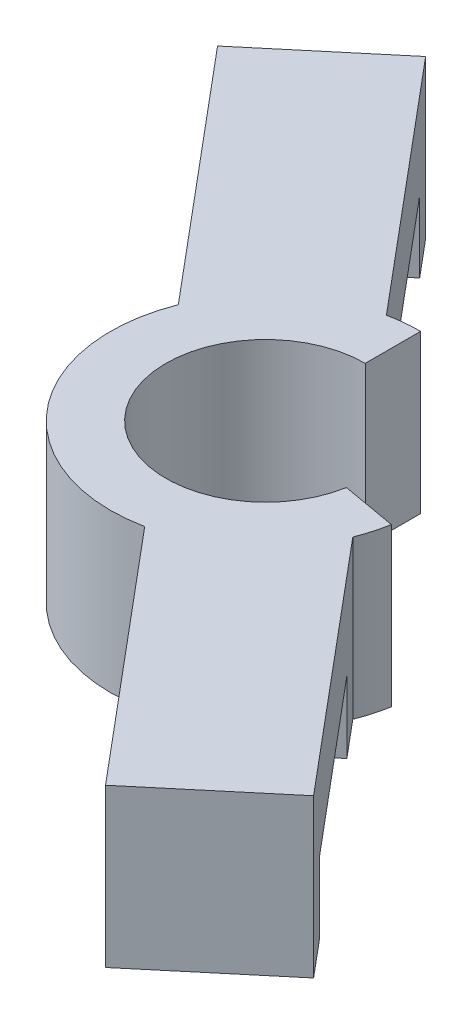
ISO-10303-21;
HEADER;
FILE_DESCRIPTION(('STEP AP214'),'2;1');
FILE_NAME('part.step','',(''),(''),'','','');
FILE_SCHEMA(('AUTOMOTIVE_DESIGN { 1 0 10303 214 1 1 1 1 }'));
ENDSEC;
DATA;
#1=APPLICATION_CONTEXT('core data for automotive mechanical design processes');
#2=APPLICATION_PROTOCOL_DEFINITION('international standard','automotive_design',2000,#1);
#3=PRODUCT_CONTEXT('',#1,'mechanical');
#4=PRODUCT('Part','Part','',(#3));
#5=PRODUCT_RELATED_PRODUCT_CATEGORY('part','',(#4));
#6=PRODUCT_DEFINITION_FORMATION('','',#4);
#7=PRODUCT_DEFINITION_CONTEXT('part definition',#1,'design');
#8=PRODUCT_DEFINITION('design','',#6,#7);
#9=PRODUCT_DEFINITION_SHAPE('','',#8);
#10=(LENGTH_UNIT() NAMED_UNIT(*) SI_UNIT(.MILLI.,.METRE.));
#11=(NAMED_UNIT(*) PLANE_ANGLE_UNIT() SI_UNIT($,.RADIAN.));
#12=(NAMED_UNIT(*) SI_UNIT($,.STERADIAN.) SOLID_ANGLE_UNIT());
#13=UNCERTAINTY_MEASURE_WITH_UNIT(LENGTH_MEASURE(1.E-05),#10,'distance_accuracy_value','');
#14=(GEOMETRIC_REPRESENTATION_CONTEXT(3) GLOBAL_UNCERTAINTY_ASSIGNED_CONTEXT((#13)) GLOBAL_UNIT_ASSIGNED_CONTEXT((#10,
#11,#12)) REPRESENTATION_CONTEXT('',''));
#15=CARTESIAN_POINT('',(0.,0.,0.));
#16=DIRECTION('',(0.,0.,1.));
#17=DIRECTION('',(1.,0.,0.));
#18=AXIS2_PLACEMENT_3D('',#15,#16,#17);
#19=CARTESIAN_POINT('',(0.,0.,0.));
#20=DIRECTION('',(0.,1.,0.));
#21=DIRECTION('',(0.,0.,1.));
#22=AXIS2_PLACEMENT_3D('',#19,#20,#21);
#23=PLANE('',#22);
#24=DIRECTION('',(-0.642787609686538,0.,-0.766044443118979));
#25=VECTOR('',#24,1.);
#26=CARTESIAN_POINT('',(3.06417777247594,0.,-2.57115043874617));
#27=LINE('',#26,#25);
#28=CARTESIAN_POINT('',(-11.0771496406279,0.,-19.4241281873637));
#29=VERTEX_POINT('',#28);
#30=CARTESIAN_POINT('',(-12.7570916906424,0.,-21.4262051608186));
#31=VERTEX_POINT('',#30);
#32=EDGE_CURVE('E316',#29,#31,#27,.T.);
#33=ORIENTED_EDGE('',*,*,#32,.F.);
#34=DIRECTION('',(-0.766044443118979,0.,0.642787609686538));
#35=VECTOR('',#34,1.);
#36=CARTESIAN_POINT('',(-14.1413274131038,0.,-16.8529777486175));
#37=LINE('',#36,#35);
#38=CARTESIAN_POINT('',(-17.2055051855797,0.,-14.2818273098714));
#39=VERTEX_POINT('',#38);
#40=EDGE_CURVE('E11',#29,#39,#37,.T.);
#41=ORIENTED_EDGE('',*,*,#40,.T.);
#42=DIRECTION('',(-0.642787609686538,0.,-0.766044443118979));
#43=VECTOR('',#42,1.);
#44=CARTESIAN_POINT('',(-3.06417777247589,0.,2.57115043874613));
#45=LINE('',#44,#43);
#46=CARTESIAN_POINT('',(-18.8854472355942,0.,-16.2839042833262));
#47=VERTEX_POINT('',#46);
#48=EDGE_CURVE('E207',#39,#47,#45,.T.);
#49=ORIENTED_EDGE('',*,*,#48,.T.);
#50=DIRECTION('',(0.766044443118979,0.,-0.642787609686538));
#51=VECTOR('',#50,1.);
#52=CARTESIAN_POINT('',(-15.8212694631183,0.,-18.8550547220724));
#53=LINE('',#52,#51);
#54=EDGE_CURVE('E213',#47,#31,#53,.T.);
#55=ORIENTED_EDGE('',*,*,#54,.T.);
#56=EDGE_LOOP('',(#33,#41,#49,#55));
#57=FACE_BOUND('',#56,.T.);
#58=ADVANCED_FACE('F45',(#57),#23,.F.);
#59=DIRECTION('',(0.642787609686538,0.,0.766044443118979));
#60=VECTOR('',#59,1.);
#61=CARTESIAN_POINT('',(-3.06417777247589,0.,2.57115043874613));
#62=LINE('',#61,#60);
#63=CARTESIAN_POINT('',(11.0771496406279,0.,19.4241281873637));
#64=VERTEX_POINT('',#63);
#65=CARTESIAN_POINT('',(12.7570916906424,0.,21.4262051608185));
#66=VERTEX_POINT('',#65);
#67=EDGE_CURVE('E211',#64,#66,#62,.T.);
#68=ORIENTED_EDGE('',*,*,#67,.F.);
#69=DIRECTION('',(0.766044443118979,0.,-0.642787609686538));
#70=VECTOR('',#69,1.);
#71=CARTESIAN_POINT('',(14.1413274131038,0.,16.8529777486175));
#72=LINE('',#71,#70);
#73=CARTESIAN_POINT('',(17.2055051855798,0.,14.2818273098714));
#74=VERTEX_POINT('',#73);
#75=EDGE_CURVE('E191',#64,#74,#72,.T.);
#76=ORIENTED_EDGE('',*,*,#75,.T.);
#77=DIRECTION('',(0.642787609686538,0.,0.766044443118979));
#78=VECTOR('',#77,1.);
#79=CARTESIAN_POINT('',(3.06417777247594,0.,-2.57115043874617));
#80=LINE('',#79,#78);
#81=CARTESIAN_POINT('',(18.8854472355942,0.,16.2839042833262));
#82=VERTEX_POINT('',#81);
#83=EDGE_CURVE('E276',#74,#82,#80,.T.);
#84=ORIENTED_EDGE('',*,*,#83,.T.);
#85=DIRECTION('',(0.766044443118979,0.,-0.642787609686538));
#86=VECTOR('',#85,1.);
#87=CARTESIAN_POINT('',(15.8212694631183,0.,18.8550547220724));
#88=LINE('',#87,#86);
#89=EDGE_CURVE('E290',#66,#82,#88,.T.);
#90=ORIENTED_EDGE('',*,*,#89,.F.);
#91=EDGE_LOOP('',(#68,#76,#84,#90));
#92=FACE_BOUND('',#91,.T.);
#93=ADVANCED_FACE('F274',(#92),#23,.F.);
#94=CARTESIAN_POINT('',(15.8212694631183,8.55,18.8550547220724));
#95=DIRECTION('',(-0.642787609686538,0.,-0.766044443118979));
#96=DIRECTION('',(-0.766044443118979,0.,0.642787609686538));
#97=AXIS2_PLACEMENT_3D('',#94,#95,#96);
#98=PLANE('',#97);
#99=ORIENTED_EDGE('',*,*,#89,.T.);
#100=DIRECTION('',(0.,-1.,0.));
#101=VECTOR('',#100,1.);
#102=CARTESIAN_POINT('',(18.8854472355942,8.55,16.2839042833262));
#103=LINE('',#102,#101);
#104=CARTESIAN_POINT('',(18.8854472355942,8.55,16.2839042833262));
#105=VERTEX_POINT('',#104);
#106=EDGE_CURVE('E262',#105,#82,#103,.T.);
#107=ORIENTED_EDGE('',*,*,#106,.F.);
#108=DIRECTION('',(0.766044443118979,0.,-0.642787609686538));
#109=VECTOR('',#108,1.);
#110=CARTESIAN_POINT('',(15.8212694631183,8.55,18.8550547220724));
#111=LINE('',#110,#109);
#112=CARTESIAN_POINT('',(12.7570916906424,8.55,21.4262051608185));
#113=VERTEX_POINT('',#112);
#114=EDGE_CURVE('E221',#113,#105,#111,.T.);
#115=ORIENTED_EDGE('',*,*,#114,.F.);
#116=DIRECTION('',(0.,-1.,0.));
#117=VECTOR('',#116,1.);
#118=CARTESIAN_POINT('',(12.7570916906424,8.55,21.4262051608185));
#119=LINE('',#118,#117);
#120=EDGE_CURVE('E222',#113,#66,#119,.T.);
#121=ORIENTED_EDGE('',*,*,#120,.T.);
#122=EDGE_LOOP('',(#99,#107,#115,#121));
#123=FACE_BOUND('',#122,.T.);
#124=ADVANCED_FACE('F47',(#123),#98,.F.);
#125=CARTESIAN_POINT('',(3.06417777247594,8.55,-2.57115043874617));
#126=DIRECTION('',(0.766044443118979,0.,-0.642787609686538));
#127=DIRECTION('',(-0.642787609686538,0.,-0.766044443118979));
#128=AXIS2_PLACEMENT_3D('',#125,#126,#127);
#129=PLANE('',#128);
#130=DIRECTION('',(0.,-1.,0.));
#131=VECTOR('',#130,1.);
#132=CARTESIAN_POINT('',(17.2055051855798,8.55,14.2818273098714));
#133=LINE('',#132,#131);
#134=CARTESIAN_POINT('',(17.2055051855798,3.87239923594268,14.2818273098714));
#135=VERTEX_POINT('',#134);
#136=EDGE_CURVE('E284',#135,#74,#133,.T.);
#137=ORIENTED_EDGE('',*,*,#136,.F.);
#138=DIRECTION('',(0.642787609686538,0.,0.766044443118979));
#139=VECTOR('',#138,1.);
#140=CARTESIAN_POINT('',(3.06417777247594,3.87239923594268,-2.57115043874617));
#141=LINE('',#140,#139);
#142=CARTESIAN_POINT('',(9.49205386934132,3.87239923594268,5.08929399244362));
#143=VERTEX_POINT('',#142);
#144=EDGE_CURVE('E412',#143,#135,#141,.T.);
#145=ORIENTED_EDGE('',*,*,#144,.F.);
#146=DIRECTION('',(0.,1.,0.));
#147=VECTOR('',#146,1.);
#148=CARTESIAN_POINT('',(9.49205386934132,8.55,5.08929399244362));
#149=LINE('',#148,#147);
#150=CARTESIAN_POINT('',(9.49205386934132,0.,5.08929399244362));
#151=VERTEX_POINT('',#150);
#152=EDGE_CURVE('E411',#151,#143,#149,.T.);
#153=ORIENTED_EDGE('',*,*,#152,.F.);
#154=CARTESIAN_POINT('',(7.81211181932685,0.,3.08721701898879));
#155=VERTEX_POINT('',#154);
#156=EDGE_CURVE('E289',#155,#151,#80,.T.);
#157=ORIENTED_EDGE('',*,*,#156,.F.);
#158=DIRECTION('',(0.,-1.,0.));
#159=VECTOR('',#158,1.);
#160=CARTESIAN_POINT('',(7.81211181932685,8.55,3.08721701898879));
#161=LINE('',#160,#159);
#162=CARTESIAN_POINT('',(7.81211181932685,8.55,3.08721701898879));
#163=VERTEX_POINT('',#162);
#164=EDGE_CURVE('E259',#163,#155,#161,.T.);
#165=ORIENTED_EDGE('',*,*,#164,.F.);
#166=DIRECTION('',(0.642787609686538,0.,0.766044443118979));
#167=VECTOR('',#166,1.);
#168=CARTESIAN_POINT('',(3.06417777247594,8.55,-2.57115043874617));
#169=LINE('',#168,#167);
#170=EDGE_CURVE('E367',#163,#105,#169,.T.);
#171=ORIENTED_EDGE('',*,*,#170,.T.);
#172=ORIENTED_EDGE('',*,*,#106,.T.);
#173=ORIENTED_EDGE('',*,*,#83,.F.);
#174=EDGE_LOOP('',(#137,#145,#153,#157,#165,#171,#172,#173));
#175=FACE_BOUND('',#174,.T.);
#176=ADVANCED_FACE('F282',(#175),#129,.T.);
#177=CARTESIAN_POINT('',(0.,8.55,0.));
#178=DIRECTION('',(0.,-1.,0.));
#179=DIRECTION('',(0.,0.,-1.));
#180=AXIS2_PLACEMENT_3D('',#177,#178,#179);
#181=CYLINDRICAL_SURFACE('',#180,8.4);
#182=CARTESIAN_POINT('',(0.,0.,0.));
#183=DIRECTION('',(0.,1.,0.));
#184=DIRECTION('',(0.,0.,1.));
#185=AXIS2_PLACEMENT_3D('',#182,#183,#184);
#186=CIRCLE('',#185,8.4);
#187=CARTESIAN_POINT('',(8.27238512530255,0.,1.45864469240225));
#188=VERTEX_POINT('',#187);
#189=EDGE_CURVE('E295',#155,#188,#186,.T.);
#190=ORIENTED_EDGE('',*,*,#189,.T.);
#191=DIRECTION('',(0.,-1.,0.));
#192=VECTOR('',#191,1.);
#193=CARTESIAN_POINT('',(8.27238512530255,8.55,1.45864469240225));
#194=LINE('',#193,#192);
#195=CARTESIAN_POINT('',(8.27238512530255,8.55,1.45864469240225));
#196=VERTEX_POINT('',#195);
#197=EDGE_CURVE('E256',#196,#188,#194,.T.);
#198=ORIENTED_EDGE('',*,*,#197,.F.);
#199=CARTESIAN_POINT('',(0.,8.55,0.));
#200=DIRECTION('',(0.,1.,0.));
#201=DIRECTION('',(0.,0.,1.));
#202=AXIS2_PLACEMENT_3D('',#199,#200,#201);
#203=CIRCLE('',#202,8.4);
#204=EDGE_CURVE('E370',#163,#196,#203,.T.);
#205=ORIENTED_EDGE('',*,*,#204,.F.);
#206=ORIENTED_EDGE('',*,*,#164,.T.);
#207=EDGE_LOOP('',(#190,#198,#205,#206));
#208=FACE_BOUND('',#207,.T.);
#209=ADVANCED_FACE('F502',(#208),#181,.T.);
#210=CARTESIAN_POINT('',(0.,8.55,0.));
#211=DIRECTION('',(0.173648177666934,0.,-0.984807753012207));
#212=DIRECTION('',(-0.984807753012207,0.,-0.173648177666934));
#213=AXIS2_PLACEMENT_3D('',#210,#211,#212);
#214=PLANE('',#213);
#215=DIRECTION('',(0.984807753012207,0.,0.173648177666934));
#216=VECTOR('',#215,1.);
#217=CARTESIAN_POINT('',(0.,0.,0.));
#218=LINE('',#217,#216);
#219=CARTESIAN_POINT('',(5.31796186626592,0.,0.937700159401445));
#220=VERTEX_POINT('',#219);
#221=EDGE_CURVE('E303',#220,#188,#218,.T.);
#222=ORIENTED_EDGE('',*,*,#221,.F.);
#223=DIRECTION('',(0.,-1.,0.));
#224=VECTOR('',#223,1.);
#225=CARTESIAN_POINT('',(5.31796186626592,8.55,0.937700159401445));
#226=LINE('',#225,#224);
#227=CARTESIAN_POINT('',(5.31796186626592,8.55,0.937700159401445));
#228=VERTEX_POINT('',#227);
#229=EDGE_CURVE('E253',#228,#220,#226,.T.);
#230=ORIENTED_EDGE('',*,*,#229,.F.);
#231=DIRECTION('',(0.984807753012207,0.,0.173648177666934));
#232=VECTOR('',#231,1.);
#233=CARTESIAN_POINT('',(0.,8.55,0.));
#234=LINE('',#233,#232);
#235=EDGE_CURVE('E377',#228,#196,#234,.T.);
#236=ORIENTED_EDGE('',*,*,#235,.T.);
#237=ORIENTED_EDGE('',*,*,#197,.T.);
#238=EDGE_LOOP('',(#222,#230,#236,#237));
#239=FACE_BOUND('',#238,.T.);
#240=ADVANCED_FACE('F404',(#239),#214,.T.);
#241=CARTESIAN_POINT('',(0.,8.55,0.));
#242=DIRECTION('',(0.,-1.,0.));
#243=DIRECTION('',(0.,0.,-1.));
#244=AXIS2_PLACEMENT_3D('',#241,#242,#243);
#245=CYLINDRICAL_SURFACE('',#244,5.4);
#246=CARTESIAN_POINT('',(0.,0.,0.));
#247=DIRECTION('',(0.,1.,0.));
#248=DIRECTION('',(0.,0.,1.));
#249=AXIS2_PLACEMENT_3D('',#246,#247,#248);
#250=CIRCLE('',#249,5.4);
#251=CARTESIAN_POINT('',(0.,0.,-5.4));
#252=VERTEX_POINT('',#251);
#253=EDGE_CURVE('E307',#252,#220,#250,.T.);
#254=ORIENTED_EDGE('',*,*,#253,.F.);
#255=DIRECTION('',(0.,-1.,0.));
#256=VECTOR('',#255,1.);
#257=CARTESIAN_POINT('',(0.,8.55,-5.4));
#258=LINE('',#257,#256);
#259=CARTESIAN_POINT('',(0.,8.55,-5.4));
#260=VERTEX_POINT('',#259);
#261=EDGE_CURVE('E250',#260,#252,#258,.T.);
#262=ORIENTED_EDGE('',*,*,#261,.F.);
#263=CARTESIAN_POINT('',(0.,8.55,0.));
#264=DIRECTION('',(0.,1.,0.));
#265=DIRECTION('',(0.,0.,1.));
#266=AXIS2_PLACEMENT_3D('',#263,#264,#265);
#267=CIRCLE('',#266,5.4);
#268=EDGE_CURVE('E381',#260,#228,#267,.T.);
#269=ORIENTED_EDGE('',*,*,#268,.T.);
#270=ORIENTED_EDGE('',*,*,#229,.T.);
#271=EDGE_LOOP('',(#254,#262,#269,#270));
#272=FACE_BOUND('',#271,.T.);
#273=ADVANCED_FACE('F400',(#272),#245,.F.);
#274=CARTESIAN_POINT('',(0.,8.55,0.));
#275=DIRECTION('',(-1.,0.,0.));
#276=DIRECTION('',(0.,0.,1.));
#277=AXIS2_PLACEMENT_3D('',#274,#275,#276);
#278=PLANE('',#277);
#279=DIRECTION('',(0.,0.,-1.));
#280=VECTOR('',#279,1.);
#281=CARTESIAN_POINT('',(0.,0.,0.));
#282=LINE('',#281,#280);
#283=CARTESIAN_POINT('',(0.,0.,-8.4));
#284=VERTEX_POINT('',#283);
#285=EDGE_CURVE('E311',#252,#284,#282,.T.);
#286=ORIENTED_EDGE('',*,*,#285,.T.);
#287=DIRECTION('',(0.,-1.,0.));
#288=VECTOR('',#287,1.);
#289=CARTESIAN_POINT('',(0.,8.55,-8.4));
#290=LINE('',#289,#288);
#291=CARTESIAN_POINT('',(0.,8.55,-8.4));
#292=VERTEX_POINT('',#291);
#293=EDGE_CURVE('E246',#292,#284,#290,.T.);
#294=ORIENTED_EDGE('',*,*,#293,.F.);
#295=DIRECTION('',(0.,0.,-1.));
#296=VECTOR('',#295,1.);
#297=CARTESIAN_POINT('',(0.,8.55,0.));
#298=LINE('',#297,#296);
#299=EDGE_CURVE('E385',#260,#292,#298,.T.);
#300=ORIENTED_EDGE('',*,*,#299,.F.);
#301=ORIENTED_EDGE('',*,*,#261,.T.);
#302=EDGE_LOOP('',(#286,#294,#300,#301));
#303=FACE_BOUND('',#302,.T.);
#304=ADVANCED_FACE('F495',(#303),#278,.F.);
#305=CARTESIAN_POINT('',(0.,8.55,0.));
#306=DIRECTION('',(0.,-1.,0.));
#307=DIRECTION('',(0.,0.,-1.));
#308=AXIS2_PLACEMENT_3D('',#305,#306,#307);
#309=CYLINDRICAL_SURFACE('',#308,8.4);
#310=CARTESIAN_POINT('',(0.,0.,0.));
#311=DIRECTION('',(0.,1.,0.));
#312=DIRECTION('',(0.,0.,1.));
#313=AXIS2_PLACEMENT_3D('',#310,#311,#312);
#314=CIRCLE('',#313,8.4);
#315=CARTESIAN_POINT('',(-1.68375627437498,0.,-8.22951789648113));
#316=VERTEX_POINT('',#315);
#317=EDGE_CURVE('E314',#284,#316,#314,.T.);
#318=ORIENTED_EDGE('',*,*,#317,.T.);
#319=DIRECTION('',(0.,-1.,0.));
#320=VECTOR('',#319,1.);
#321=CARTESIAN_POINT('',(-1.68375627437498,8.55,-8.22951789648113));
#322=LINE('',#321,#320);
#323=CARTESIAN_POINT('',(-1.68375627437498,8.55,-8.22951789648113));
#324=VERTEX_POINT('',#323);
#325=EDGE_CURVE('E242',#324,#316,#322,.T.);
#326=ORIENTED_EDGE('',*,*,#325,.F.);
#327=CARTESIAN_POINT('',(0.,8.55,0.));
#328=DIRECTION('',(0.,1.,0.));
#329=DIRECTION('',(0.,0.,1.));
#330=AXIS2_PLACEMENT_3D('',#327,#328,#329);
#331=CIRCLE('',#330,8.4);
#332=EDGE_CURVE('E350',#292,#324,#331,.T.);
#333=ORIENTED_EDGE('',*,*,#332,.F.);
#334=ORIENTED_EDGE('',*,*,#293,.T.);
#335=EDGE_LOOP('',(#318,#326,#333,#334));
#336=FACE_BOUND('',#335,.T.);
#337=ADVANCED_FACE('F394',(#336),#309,.T.);
#338=CARTESIAN_POINT('',(3.06417777247594,8.55,-2.57115043874617));
#339=DIRECTION('',(-0.766044443118979,0.,0.642787609686538));
#340=DIRECTION('',(0.642787609686538,0.,0.766044443118979));
#341=AXIS2_PLACEMENT_3D('',#338,#339,#340);
#342=PLANE('',#341);
#343=DIRECTION('',(-0.642787609686538,0.,-0.766044443118979));
#344=VECTOR('',#343,1.);
#345=CARTESIAN_POINT('',(3.06417777247594,3.87239923594268,-2.57115043874617));
#346=LINE('',#345,#344);
#347=CARTESIAN_POINT('',(-3.36369832438943,3.87239923594268,-10.231594869936));
#348=VERTEX_POINT('',#347);
#349=CARTESIAN_POINT('',(-11.0771496406279,3.87239923594268,-19.4241281873637));
#350=VERTEX_POINT('',#349);
#351=EDGE_CURVE('E296',#348,#350,#346,.T.);
#352=ORIENTED_EDGE('',*,*,#351,.T.);
#353=DIRECTION('',(0.,-1.,0.));
#354=VECTOR('',#353,1.);
#355=CARTESIAN_POINT('',(-11.0771496406279,8.55,-19.4241281873637));
#356=LINE('',#355,#354);
#357=EDGE_CURVE('E330',#350,#29,#356,.T.);
#358=ORIENTED_EDGE('',*,*,#357,.T.);
#359=ORIENTED_EDGE('',*,*,#32,.T.);
#360=DIRECTION('',(0.,-1.,0.));
#361=VECTOR('',#360,1.);
#362=CARTESIAN_POINT('',(-12.7570916906424,8.55,-21.4262051608186));
#363=LINE('',#362,#361);
#364=CARTESIAN_POINT('',(-12.7570916906424,8.55,-21.4262051608186));
#365=VERTEX_POINT('',#364);
#366=EDGE_CURVE('E238',#365,#31,#363,.T.);
#367=ORIENTED_EDGE('',*,*,#366,.F.);
#368=DIRECTION('',(-0.642787609686538,0.,-0.766044443118979));
#369=VECTOR('',#368,1.);
#370=CARTESIAN_POINT('',(3.06417777247594,8.55,-2.57115043874617));
#371=LINE('',#370,#369);
#372=EDGE_CURVE('E343',#324,#365,#371,.T.);
#373=ORIENTED_EDGE('',*,*,#372,.F.);
#374=ORIENTED_EDGE('',*,*,#325,.T.);
#375=CARTESIAN_POINT('',(-3.36369832438943,0.,-10.231594869936));
#376=VERTEX_POINT('',#375);
#377=EDGE_CURVE('E317',#316,#376,#27,.T.);
#378=ORIENTED_EDGE('',*,*,#377,.T.);
#379=DIRECTION('',(0.,1.,0.));
#380=VECTOR('',#379,1.);
#381=CARTESIAN_POINT('',(-3.36369832438943,8.55,-10.231594869936));
#382=LINE('',#381,#380);
#383=EDGE_CURVE('E61',#376,#348,#382,.T.);
#384=ORIENTED_EDGE('',*,*,#383,.T.);
#385=EDGE_LOOP('',(#352,#358,#359,#367,#373,#374,#378,#384));
#386=FACE_BOUND('',#385,.T.);
#387=ADVANCED_FACE('F327',(#386),#342,.F.);
#388=CARTESIAN_POINT('',(-15.8212694631183,8.55,-18.8550547220724));
#389=DIRECTION('',(-0.642787609686538,0.,-0.766044443118979));
#390=DIRECTION('',(-0.766044443118979,0.,0.642787609686538));
#391=AXIS2_PLACEMENT_3D('',#388,#389,#390);
#392=PLANE('',#391);
#393=ORIENTED_EDGE('',*,*,#54,.F.);
#394=DIRECTION('',(0.,-1.,0.));
#395=VECTOR('',#394,1.);
#396=CARTESIAN_POINT('',(-18.8854472355942,8.55,-16.2839042833262));
#397=LINE('',#396,#395);
#398=CARTESIAN_POINT('',(-18.8854472355942,8.55,-16.2839042833262));
#399=VERTEX_POINT('',#398);
#400=EDGE_CURVE('E234',#399,#47,#397,.T.);
#401=ORIENTED_EDGE('',*,*,#400,.F.);
#402=DIRECTION('',(0.766044443118979,0.,-0.642787609686538));
#403=VECTOR('',#402,1.);
#404=CARTESIAN_POINT('',(-15.8212694631183,8.55,-18.8550547220724));
#405=LINE('',#404,#403);
#406=EDGE_CURVE('E336',#399,#365,#405,.T.);
#407=ORIENTED_EDGE('',*,*,#406,.T.);
#408=ORIENTED_EDGE('',*,*,#366,.T.);
#409=EDGE_LOOP('',(#393,#401,#407,#408));
#410=FACE_BOUND('',#409,.T.);
#411=ADVANCED_FACE('F334',(#410),#392,.T.);
#412=CARTESIAN_POINT('',(-3.06417777247589,8.55,2.57115043874613));
#413=DIRECTION('',(-0.766044443118979,0.,0.642787609686538));
#414=DIRECTION('',(0.642787609686538,0.,0.766044443118979));
#415=AXIS2_PLACEMENT_3D('',#412,#413,#414);
#416=PLANE('',#415);
#417=DIRECTION('',(0.,-1.,0.));
#418=VECTOR('',#417,1.);
#419=CARTESIAN_POINT('',(-17.2055051855797,0.,-14.2818273098714));
#420=LINE('',#419,#418);
#421=CARTESIAN_POINT('',(-17.2055051855797,3.87239923594268,-14.2818273098714));
#422=VERTEX_POINT('',#421);
#423=EDGE_CURVE('E436',#422,#39,#420,.T.);
#424=ORIENTED_EDGE('',*,*,#423,.F.);
#425=DIRECTION('',(-0.642787609686538,0.,-0.766044443118979));
#426=VECTOR('',#425,1.);
#427=CARTESIAN_POINT('',(-17.2055051855797,3.87239923594268,-14.2818273098714));
#428=LINE('',#427,#426);
#429=CARTESIAN_POINT('',(-9.49205386934127,3.87239923594268,-5.08929399244366));
#430=VERTEX_POINT('',#429);
#431=EDGE_CURVE('E198',#430,#422,#428,.T.);
#432=ORIENTED_EDGE('',*,*,#431,.F.);
#433=DIRECTION('',(0.,1.,0.));
#434=VECTOR('',#433,1.);
#435=CARTESIAN_POINT('',(-9.49205386934127,3.87239923594268,-5.08929399244366));
#436=LINE('',#435,#434);
#437=CARTESIAN_POINT('',(-9.49205386934127,0.,-5.08929399244366));
#438=VERTEX_POINT('',#437);
#439=EDGE_CURVE('E184',#438,#430,#436,.T.);
#440=ORIENTED_EDGE('',*,*,#439,.F.);
#441=CARTESIAN_POINT('',(-7.81211181932681,0.,-3.08721701898885));
#442=VERTEX_POINT('',#441);
#443=EDGE_CURVE('E196',#442,#438,#45,.T.);
#444=ORIENTED_EDGE('',*,*,#443,.F.);
#445=DIRECTION('',(0.,-1.,0.));
#446=VECTOR('',#445,1.);
#447=CARTESIAN_POINT('',(-7.81211181932681,8.55,-3.08721701898885));
#448=LINE('',#447,#446);
#449=CARTESIAN_POINT('',(-7.81211181932681,8.55,-3.08721701898885));
#450=VERTEX_POINT('',#449);
#451=EDGE_CURVE('E231',#450,#442,#448,.T.);
#452=ORIENTED_EDGE('',*,*,#451,.F.);
#453=DIRECTION('',(-0.642787609686538,0.,-0.766044443118979));
#454=VECTOR('',#453,1.);
#455=CARTESIAN_POINT('',(-3.06417777247589,8.55,2.57115043874613));
#456=LINE('',#455,#454);
#457=EDGE_CURVE('E340',#450,#399,#456,.T.);
#458=ORIENTED_EDGE('',*,*,#457,.T.);
#459=ORIENTED_EDGE('',*,*,#400,.T.);
#460=ORIENTED_EDGE('',*,*,#48,.F.);
#461=EDGE_LOOP('',(#424,#432,#440,#444,#452,#458,#459,#460));
#462=FACE_BOUND('',#461,.T.);
#463=ADVANCED_FACE('F195',(#462),#416,.T.);
#464=CARTESIAN_POINT('',(0.,8.55,0.));
#465=DIRECTION('',(0.,-1.,0.));
#466=DIRECTION('',(0.,0.,-1.));
#467=AXIS2_PLACEMENT_3D('',#464,#465,#466);
#468=CYLINDRICAL_SURFACE('',#467,8.4);
#469=CARTESIAN_POINT('',(0.,0.,0.));
#470=DIRECTION('',(0.,1.,0.));
#471=DIRECTION('',(0.,0.,1.));
#472=AXIS2_PLACEMENT_3D('',#469,#470,#471);
#473=CIRCLE('',#472,8.4);
#474=CARTESIAN_POINT('',(1.68375627437503,0.,8.2295178964811));
#475=VERTEX_POINT('',#474);
#476=EDGE_CURVE('E205',#442,#475,#473,.T.);
#477=ORIENTED_EDGE('',*,*,#476,.T.);
#478=DIRECTION('',(0.,-1.,0.));
#479=VECTOR('',#478,1.);
#480=CARTESIAN_POINT('',(1.68375627437503,8.55,8.2295178964811));
#481=LINE('',#480,#479);
#482=CARTESIAN_POINT('',(1.68375627437503,8.55,8.2295178964811));
#483=VERTEX_POINT('',#482);
#484=EDGE_CURVE('E226',#483,#475,#481,.T.);
#485=ORIENTED_EDGE('',*,*,#484,.F.);
#486=CARTESIAN_POINT('',(0.,8.55,0.));
#487=DIRECTION('',(0.,1.,0.));
#488=DIRECTION('',(0.,0.,1.));
#489=AXIS2_PLACEMENT_3D('',#486,#487,#488);
#490=CIRCLE('',#489,8.4);
#491=EDGE_CURVE('E348',#450,#483,#490,.T.);
#492=ORIENTED_EDGE('',*,*,#491,.F.);
#493=ORIENTED_EDGE('',*,*,#451,.T.);
#494=EDGE_LOOP('',(#477,#485,#492,#493));
#495=FACE_BOUND('',#494,.T.);
#496=ADVANCED_FACE('F480',(#495),#468,.T.);
#497=CARTESIAN_POINT('',(-3.06417777247589,8.55,2.57115043874613));
#498=DIRECTION('',(0.766044443118979,0.,-0.642787609686538));
#499=DIRECTION('',(-0.642787609686538,0.,-0.766044443118979));
#500=AXIS2_PLACEMENT_3D('',#497,#498,#499);
#501=PLANE('',#500);
#502=DIRECTION('',(-0.642787609686538,0.,-0.766044443118979));
#503=VECTOR('',#502,1.);
#504=CARTESIAN_POINT('',(11.0771496406279,3.87239923594268,19.4241281873637));
#505=LINE('',#504,#503);
#506=CARTESIAN_POINT('',(11.0771496406279,3.87239923594268,19.4241281873637));
#507=VERTEX_POINT('',#506);
#508=CARTESIAN_POINT('',(3.36369832438949,3.87239923594268,10.2315948699359));
#509=VERTEX_POINT('',#508);
#510=EDGE_CURVE('E200',#507,#509,#505,.T.);
#511=ORIENTED_EDGE('',*,*,#510,.F.);
#512=DIRECTION('',(0.,1.,0.));
#513=VECTOR('',#512,1.);
#514=CARTESIAN_POINT('',(11.0771496406279,0.,19.4241281873637));
#515=LINE('',#514,#513);
#516=EDGE_CURVE('E444',#64,#507,#515,.T.);
#517=ORIENTED_EDGE('',*,*,#516,.F.);
#518=ORIENTED_EDGE('',*,*,#67,.T.);
#519=ORIENTED_EDGE('',*,*,#120,.F.);
#520=DIRECTION('',(0.642787609686538,0.,0.766044443118979));
#521=VECTOR('',#520,1.);
#522=CARTESIAN_POINT('',(-3.06417777247589,8.55,2.57115043874613));
#523=LINE('',#522,#521);
#524=EDGE_CURVE('E227',#483,#113,#523,.T.);
#525=ORIENTED_EDGE('',*,*,#524,.F.);
#526=ORIENTED_EDGE('',*,*,#484,.T.);
#527=CARTESIAN_POINT('',(3.36369832438949,0.,10.2315948699359));
#528=VERTEX_POINT('',#527);
#529=EDGE_CURVE('E217',#475,#528,#62,.T.);
#530=ORIENTED_EDGE('',*,*,#529,.T.);
#531=DIRECTION('',(0.,-1.,0.));
#532=VECTOR('',#531,1.);
#533=CARTESIAN_POINT('',(3.36369832438949,3.87239923594268,10.2315948699359));
#534=LINE('',#533,#532);
#535=EDGE_CURVE('E69',#509,#528,#534,.T.);
#536=ORIENTED_EDGE('',*,*,#535,.F.);
#537=EDGE_LOOP('',(#511,#517,#518,#519,#525,#526,#530,#536));
#538=FACE_BOUND('',#537,.T.);
#539=ADVANCED_FACE('F364',(#538),#501,.F.);
#540=CARTESIAN_POINT('',(0.,8.55,0.));
#541=DIRECTION('',(0.,1.,0.));
#542=DIRECTION('',(0.,0.,1.));
#543=AXIS2_PLACEMENT_3D('',#540,#541,#542);
#544=PLANE('',#543);
#545=ORIENTED_EDGE('',*,*,#114,.T.);
#546=ORIENTED_EDGE('',*,*,#170,.F.);
#547=ORIENTED_EDGE('',*,*,#204,.T.);
#548=ORIENTED_EDGE('',*,*,#235,.F.);
#549=ORIENTED_EDGE('',*,*,#268,.F.);
#550=ORIENTED_EDGE('',*,*,#299,.T.);
#551=ORIENTED_EDGE('',*,*,#332,.T.);
#552=ORIENTED_EDGE('',*,*,#372,.T.);
#553=ORIENTED_EDGE('',*,*,#406,.F.);
#554=ORIENTED_EDGE('',*,*,#457,.F.);
#555=ORIENTED_EDGE('',*,*,#491,.T.);
#556=ORIENTED_EDGE('',*,*,#524,.T.);
#557=EDGE_LOOP('',(#545,#546,#547,#548,#549,#550,#551,#552,#553,#554,#555,#556));
#558=FACE_BOUND('',#557,.T.);
#559=ADVANCED_FACE('F342',(#558),#544,.T.);
#560=ORIENTED_EDGE('',*,*,#443,.T.);
#561=DIRECTION('',(0.766044443118979,0.,-0.642787609686538));
#562=VECTOR('',#561,1.);
#563=CARTESIAN_POINT('',(-6.42787609686538,0.,-7.66044443118979));
#564=LINE('',#563,#562);
#565=EDGE_CURVE('E54',#438,#376,#564,.T.);
#566=ORIENTED_EDGE('',*,*,#565,.T.);
#567=ORIENTED_EDGE('',*,*,#377,.F.);
#568=ORIENTED_EDGE('',*,*,#317,.F.);
#569=ORIENTED_EDGE('',*,*,#285,.F.);
#570=ORIENTED_EDGE('',*,*,#253,.T.);
#571=ORIENTED_EDGE('',*,*,#221,.T.);
#572=ORIENTED_EDGE('',*,*,#189,.F.);
#573=ORIENTED_EDGE('',*,*,#156,.T.);
#574=DIRECTION('',(-0.766044443118979,0.,0.642787609686538));
#575=VECTOR('',#574,1.);
#576=CARTESIAN_POINT('',(6.42787609686538,0.,7.66044443118979));
#577=LINE('',#576,#575);
#578=EDGE_CURVE('E266',#151,#528,#577,.T.);
#579=ORIENTED_EDGE('',*,*,#578,.T.);
#580=ORIENTED_EDGE('',*,*,#529,.F.);
#581=ORIENTED_EDGE('',*,*,#476,.F.);
#582=EDGE_LOOP('',(#560,#566,#567,#568,#569,#570,#571,#572,#573,#579,#580,#581));
#583=FACE_BOUND('',#582,.T.);
#584=ADVANCED_FACE('F203',(#583),#23,.F.);
#585=CARTESIAN_POINT('',(18.7375940718177,3.87239923594268,12.9962520904983));
#586=DIRECTION('',(0.,1.,0.));
#587=DIRECTION('',(0.,0.,1.));
#588=AXIS2_PLACEMENT_3D('',#585,#586,#587);
#589=PLANE('',#588);
#590=ORIENTED_EDGE('',*,*,#144,.T.);
#591=DIRECTION('',(-0.766044443118979,0.,0.642787609686538));
#592=VECTOR('',#591,1.);
#593=CARTESIAN_POINT('',(18.7375940718177,3.87239923594268,12.9962520904983));
#594=LINE('',#593,#592);
#595=EDGE_CURVE('E445',#135,#507,#594,.T.);
#596=ORIENTED_EDGE('',*,*,#595,.T.);
#597=ORIENTED_EDGE('',*,*,#510,.T.);
#598=DIRECTION('',(-0.766044443118979,0.,0.642787609686538));
#599=VECTOR('',#598,1.);
#600=CARTESIAN_POINT('',(11.0241427555793,3.87239923594268,3.80371877307054));
#601=LINE('',#600,#599);
#602=EDGE_CURVE('E441',#143,#509,#601,.T.);
#603=ORIENTED_EDGE('',*,*,#602,.F.);
#604=EDGE_LOOP('',(#590,#596,#597,#603));
#605=FACE_BOUND('',#604,.T.);
#606=ADVANCED_FACE('F452',(#605),#589,.F.);
#607=CARTESIAN_POINT('',(18.7375940718177,0.,12.9962520904983));
#608=DIRECTION('',(0.642787609686538,0.,0.766044443118979));
#609=DIRECTION('',(0.766044443118979,0.,-0.642787609686538));
#610=AXIS2_PLACEMENT_3D('',#607,#608,#609);
#611=PLANE('',#610);
#612=ORIENTED_EDGE('',*,*,#136,.T.);
#613=ORIENTED_EDGE('',*,*,#75,.F.);
#614=ORIENTED_EDGE('',*,*,#516,.T.);
#615=ORIENTED_EDGE('',*,*,#595,.F.);
#616=EDGE_LOOP('',(#612,#613,#614,#615));
#617=FACE_BOUND('',#616,.T.);
#618=ADVANCED_FACE('F455',(#617),#611,.F.);
#619=CARTESIAN_POINT('',(11.0241427555793,3.87239923594268,3.80371877307054));
#620=DIRECTION('',(-0.642787609686538,0.,-0.766044443118979));
#621=DIRECTION('',(-0.766044443118979,0.,0.642787609686538));
#622=AXIS2_PLACEMENT_3D('',#619,#620,#621);
#623=PLANE('',#622);
#624=ORIENTED_EDGE('',*,*,#152,.T.);
#625=ORIENTED_EDGE('',*,*,#602,.T.);
#626=ORIENTED_EDGE('',*,*,#535,.T.);
#627=ORIENTED_EDGE('',*,*,#578,.F.);
#628=EDGE_LOOP('',(#624,#625,#626,#627));
#629=FACE_BOUND('',#628,.T.);
#630=ADVANCED_FACE('F453',(#629),#623,.F.);
#631=CARTESIAN_POINT('',(-9.54506075438993,3.87239923594268,-20.7097034067368));
#632=DIRECTION('',(0.,1.,0.));
#633=DIRECTION('',(0.,0.,1.));
#634=AXIS2_PLACEMENT_3D('',#631,#632,#633);
#635=PLANE('',#634);
#636=DIRECTION('',(-0.766044443118979,0.,0.642787609686538));
#637=VECTOR('',#636,1.);
#638=CARTESIAN_POINT('',(-1.83160943815147,3.87239923594268,-11.517170089309));
#639=LINE('',#638,#637);
#640=EDGE_CURVE('E420',#348,#430,#639,.T.);
#641=ORIENTED_EDGE('',*,*,#640,.T.);
#642=ORIENTED_EDGE('',*,*,#431,.T.);
#643=DIRECTION('',(-0.766044443118979,0.,0.642787609686538));
#644=VECTOR('',#643,1.);
#645=CARTESIAN_POINT('',(-9.54506075438993,3.87239923594268,-20.7097034067368));
#646=LINE('',#645,#644);
#647=EDGE_CURVE('E415',#350,#422,#646,.T.);
#648=ORIENTED_EDGE('',*,*,#647,.F.);
#649=ORIENTED_EDGE('',*,*,#351,.F.);
#650=EDGE_LOOP('',(#641,#642,#648,#649));
#651=FACE_BOUND('',#650,.T.);
#652=ADVANCED_FACE('F434',(#651),#635,.F.);
#653=CARTESIAN_POINT('',(-9.54506075438993,0.,-20.7097034067368));
#654=DIRECTION('',(-0.642787609686538,0.,-0.766044443118979));
#655=DIRECTION('',(-0.766044443118979,0.,0.642787609686538));
#656=AXIS2_PLACEMENT_3D('',#653,#654,#655);
#657=PLANE('',#656);
#658=ORIENTED_EDGE('',*,*,#647,.T.);
#659=ORIENTED_EDGE('',*,*,#423,.T.);
#660=ORIENTED_EDGE('',*,*,#40,.F.);
#661=ORIENTED_EDGE('',*,*,#357,.F.);
#662=EDGE_LOOP('',(#658,#659,#660,#661));
#663=FACE_BOUND('',#662,.T.);
#664=ADVANCED_FACE('F461',(#663),#657,.F.);
#665=CARTESIAN_POINT('',(-1.83160943815147,3.87239923594268,-11.517170089309));
#666=DIRECTION('',(0.642787609686538,0.,0.766044443118979));
#667=DIRECTION('',(0.766044443118979,0.,-0.642787609686538));
#668=AXIS2_PLACEMENT_3D('',#665,#666,#667);
#669=PLANE('',#668);
#670=ORIENTED_EDGE('',*,*,#565,.F.);
#671=ORIENTED_EDGE('',*,*,#439,.T.);
#672=ORIENTED_EDGE('',*,*,#640,.F.);
#673=ORIENTED_EDGE('',*,*,#383,.F.);
#674=EDGE_LOOP('',(#670,#671,#672,#673));
#675=FACE_BOUND('',#674,.T.);
#676=ADVANCED_FACE('F183',(#675),#669,.F.);
#677=CLOSED_SHELL('',(#58,#93,#124,#176,#209,#240,#273,#304,#337,#387,#411,#463,#496,#539,#559,
#584,#606,#618,#630,#652,#664,#676));
#678=MANIFOLD_SOLID_BREP('B2',#677);
#679=ADVANCED_BREP_SHAPE_REPRESENTATION('',(#18,#678),#14);
#680=SHAPE_DEFINITION_REPRESENTATION(#9,#679);
ENDSEC;
END-ISO-10303-21;
